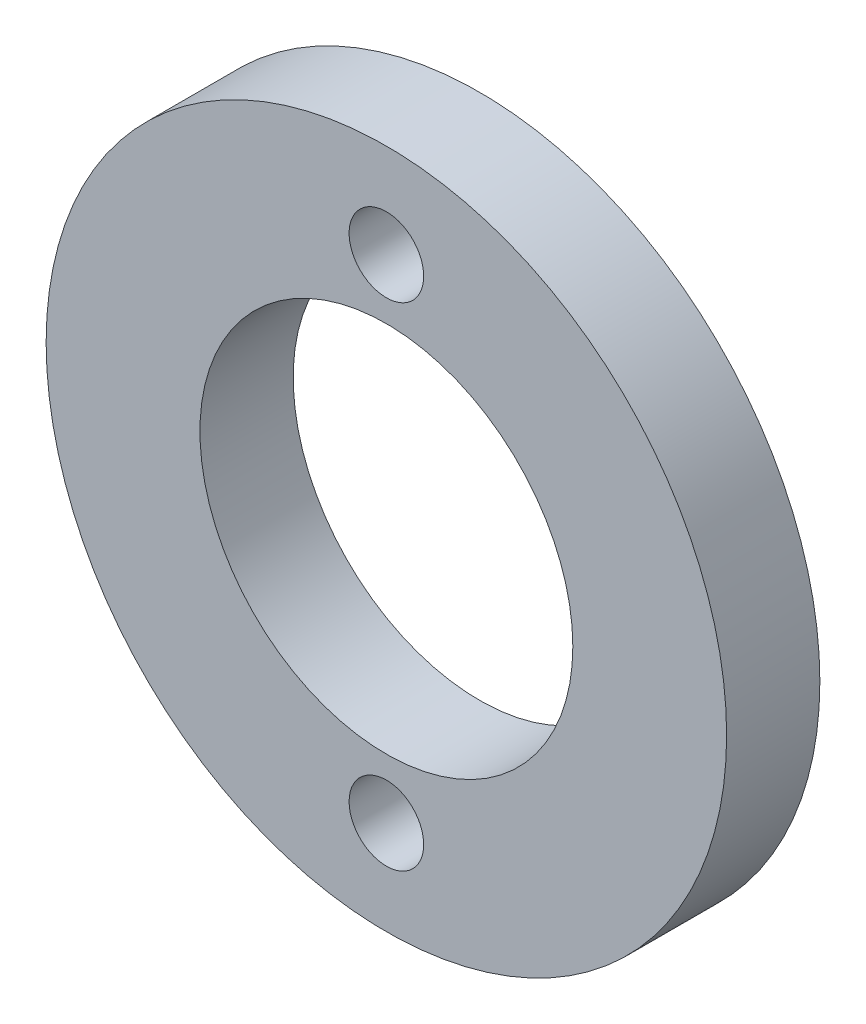
ISO-10303-21;
HEADER;
FILE_DESCRIPTION(('STEP AP214'),'2;1');
FILE_NAME('part.step','',(''),(''),'','','');
FILE_SCHEMA(('AUTOMOTIVE_DESIGN { 1 0 10303 214 1 1 1 1 }'));
ENDSEC;
DATA;
#1=APPLICATION_CONTEXT('core data for automotive mechanical design processes');
#2=APPLICATION_PROTOCOL_DEFINITION('international standard','automotive_design',2000,#1);
#3=PRODUCT_CONTEXT('',#1,'mechanical');
#4=PRODUCT('Part','Part','',(#3));
#5=PRODUCT_RELATED_PRODUCT_CATEGORY('part','',(#4));
#6=PRODUCT_DEFINITION_FORMATION('','',#4);
#7=PRODUCT_DEFINITION_CONTEXT('part definition',#1,'design');
#8=PRODUCT_DEFINITION('design','',#6,#7);
#9=PRODUCT_DEFINITION_SHAPE('','',#8);
#10=(LENGTH_UNIT() NAMED_UNIT(*) SI_UNIT(.MILLI.,.METRE.));
#11=(NAMED_UNIT(*) PLANE_ANGLE_UNIT() SI_UNIT($,.RADIAN.));
#12=(NAMED_UNIT(*) SI_UNIT($,.STERADIAN.) SOLID_ANGLE_UNIT());
#13=UNCERTAINTY_MEASURE_WITH_UNIT(LENGTH_MEASURE(1.E-05),#10,'distance_accuracy_value','');
#14=(GEOMETRIC_REPRESENTATION_CONTEXT(3) GLOBAL_UNCERTAINTY_ASSIGNED_CONTEXT((#13)) GLOBAL_UNIT_ASSIGNED_CONTEXT((#10,
#11,#12)) REPRESENTATION_CONTEXT('',''));
#15=CARTESIAN_POINT('',(0.,0.,0.));
#16=DIRECTION('',(0.,0.,1.));
#17=DIRECTION('',(1.,0.,0.));
#18=AXIS2_PLACEMENT_3D('',#15,#16,#17);
#19=CARTESIAN_POINT('',(0.,0.,5.));
#20=DIRECTION('',(0.,0.,1.));
#21=DIRECTION('',(1.,0.,0.));
#22=AXIS2_PLACEMENT_3D('',#19,#20,#21);
#23=PLANE('',#22);
#24=CARTESIAN_POINT('',(0.,-13.2,5.));
#25=DIRECTION('',(0.,0.,1.));
#26=DIRECTION('',(-1.,0.,0.));
#27=AXIS2_PLACEMENT_3D('',#24,#25,#26);
#28=CIRCLE('',#27,2.);
#29=CARTESIAN_POINT('',(-2.,-13.2,5.));
#30=VERTEX_POINT('',#29);
#31=EDGE_CURVE('E47',#30,#30,#28,.T.);
#32=ORIENTED_EDGE('',*,*,#31,.F.);
#33=EDGE_LOOP('',(#32));
#34=FACE_BOUND('',#33,.T.);
#35=CARTESIAN_POINT('',(0.,0.,5.));
#36=DIRECTION('',(0.,0.,1.));
#37=DIRECTION('',(1.,0.,0.));
#38=AXIS2_PLACEMENT_3D('',#35,#36,#37);
#39=CIRCLE('',#38,18.25);
#40=CARTESIAN_POINT('',(18.25,0.,5.));
#41=VERTEX_POINT('',#40);
#42=EDGE_CURVE('E10',#41,#41,#39,.T.);
#43=ORIENTED_EDGE('',*,*,#42,.T.);
#44=EDGE_LOOP('',(#43));
#45=FACE_BOUND('',#44,.T.);
#46=CARTESIAN_POINT('',(0.,13.2,5.));
#47=DIRECTION('',(0.,0.,1.));
#48=DIRECTION('',(1.,0.,0.));
#49=AXIS2_PLACEMENT_3D('',#46,#47,#48);
#50=CIRCLE('',#49,2.);
#51=CARTESIAN_POINT('',(2.,13.2,5.));
#52=VERTEX_POINT('',#51);
#53=EDGE_CURVE('E42',#52,#52,#50,.T.);
#54=ORIENTED_EDGE('',*,*,#53,.F.);
#55=EDGE_LOOP('',(#54));
#56=FACE_BOUND('',#55,.T.);
#57=CARTESIAN_POINT('',(0.,0.,5.));
#58=DIRECTION('',(0.,0.,1.));
#59=DIRECTION('',(1.,0.,0.));
#60=AXIS2_PLACEMENT_3D('',#57,#58,#59);
#61=CIRCLE('',#60,10.);
#62=CARTESIAN_POINT('',(10.,0.,5.));
#63=VERTEX_POINT('',#62);
#64=EDGE_CURVE('E53',#63,#63,#61,.T.);
#65=ORIENTED_EDGE('',*,*,#64,.F.);
#66=EDGE_LOOP('',(#65));
#67=FACE_BOUND('',#66,.T.);
#68=ADVANCED_FACE('F31',(#34,#45,#56,#67),#23,.T.);
#69=CARTESIAN_POINT('',(0.,0.,0.));
#70=DIRECTION('',(0.,0.,1.));
#71=DIRECTION('',(1.,0.,0.));
#72=AXIS2_PLACEMENT_3D('',#69,#70,#71);
#73=PLANE('',#72);
#74=CARTESIAN_POINT('',(0.,0.,0.));
#75=DIRECTION('',(0.,0.,1.));
#76=DIRECTION('',(1.,0.,0.));
#77=AXIS2_PLACEMENT_3D('',#74,#75,#76);
#78=CIRCLE('',#77,18.25);
#79=CARTESIAN_POINT('',(18.25,0.,0.));
#80=VERTEX_POINT('',#79);
#81=EDGE_CURVE('E35',#80,#80,#78,.T.);
#82=ORIENTED_EDGE('',*,*,#81,.F.);
#83=EDGE_LOOP('',(#82));
#84=FACE_BOUND('',#83,.T.);
#85=CARTESIAN_POINT('',(0.,13.2,0.));
#86=DIRECTION('',(0.,0.,1.));
#87=DIRECTION('',(1.,0.,0.));
#88=AXIS2_PLACEMENT_3D('',#85,#86,#87);
#89=CIRCLE('',#88,2.);
#90=CARTESIAN_POINT('',(2.,13.2,0.));
#91=VERTEX_POINT('',#90);
#92=EDGE_CURVE('E44',#91,#91,#89,.T.);
#93=ORIENTED_EDGE('',*,*,#92,.T.);
#94=EDGE_LOOP('',(#93));
#95=FACE_BOUND('',#94,.T.);
#96=CARTESIAN_POINT('',(0.,-13.2,0.));
#97=DIRECTION('',(0.,0.,1.));
#98=DIRECTION('',(-1.,0.,0.));
#99=AXIS2_PLACEMENT_3D('',#96,#97,#98);
#100=CIRCLE('',#99,2.);
#101=CARTESIAN_POINT('',(-2.,-13.2,0.));
#102=VERTEX_POINT('',#101);
#103=EDGE_CURVE('E50',#102,#102,#100,.T.);
#104=ORIENTED_EDGE('',*,*,#103,.T.);
#105=EDGE_LOOP('',(#104));
#106=FACE_BOUND('',#105,.T.);
#107=CARTESIAN_POINT('',(0.,0.,0.));
#108=DIRECTION('',(0.,0.,1.));
#109=DIRECTION('',(1.,0.,0.));
#110=AXIS2_PLACEMENT_3D('',#107,#108,#109);
#111=CIRCLE('',#110,10.);
#112=CARTESIAN_POINT('',(10.,0.,0.));
#113=VERTEX_POINT('',#112);
#114=EDGE_CURVE('E56',#113,#113,#111,.T.);
#115=ORIENTED_EDGE('',*,*,#114,.T.);
#116=EDGE_LOOP('',(#115));
#117=FACE_BOUND('',#116,.T.);
#118=ADVANCED_FACE('F66',(#84,#95,#106,#117),#73,.F.);
#119=CARTESIAN_POINT('',(0.,0.,5.));
#120=DIRECTION('',(0.,0.,-1.));
#121=DIRECTION('',(-1.,0.,0.));
#122=AXIS2_PLACEMENT_3D('',#119,#120,#121);
#123=CYLINDRICAL_SURFACE('',#122,18.25);
#124=ORIENTED_EDGE('',*,*,#42,.F.);
#125=EDGE_LOOP('',(#124));
#126=FACE_BOUND('',#125,.T.);
#127=ORIENTED_EDGE('',*,*,#81,.T.);
#128=EDGE_LOOP('',(#127));
#129=FACE_BOUND('',#128,.T.);
#130=ADVANCED_FACE('F33',(#126,#129),#123,.T.);
#131=CARTESIAN_POINT('',(0.,13.2,5.));
#132=DIRECTION('',(0.,0.,-1.));
#133=DIRECTION('',(-1.,0.,0.));
#134=AXIS2_PLACEMENT_3D('',#131,#132,#133);
#135=CYLINDRICAL_SURFACE('',#134,2.);
#136=ORIENTED_EDGE('',*,*,#53,.T.);
#137=EDGE_LOOP('',(#136));
#138=FACE_BOUND('',#137,.T.);
#139=ORIENTED_EDGE('',*,*,#92,.F.);
#140=EDGE_LOOP('',(#139));
#141=FACE_BOUND('',#140,.T.);
#142=ADVANCED_FACE('F75',(#138,#141),#135,.F.);
#143=CARTESIAN_POINT('',(0.,-13.2,5.));
#144=DIRECTION('',(0.,0.,-1.));
#145=DIRECTION('',(-1.,0.,0.));
#146=AXIS2_PLACEMENT_3D('',#143,#144,#145);
#147=CYLINDRICAL_SURFACE('',#146,2.);
#148=ORIENTED_EDGE('',*,*,#31,.T.);
#149=EDGE_LOOP('',(#148));
#150=FACE_BOUND('',#149,.T.);
#151=ORIENTED_EDGE('',*,*,#103,.F.);
#152=EDGE_LOOP('',(#151));
#153=FACE_BOUND('',#152,.T.);
#154=ADVANCED_FACE('F78',(#150,#153),#147,.F.);
#155=CARTESIAN_POINT('',(0.,0.,5.));
#156=DIRECTION('',(0.,0.,-1.));
#157=DIRECTION('',(-1.,0.,0.));
#158=AXIS2_PLACEMENT_3D('',#155,#156,#157);
#159=CYLINDRICAL_SURFACE('',#158,10.);
#160=ORIENTED_EDGE('',*,*,#64,.T.);
#161=EDGE_LOOP('',(#160));
#162=FACE_BOUND('',#161,.T.);
#163=ORIENTED_EDGE('',*,*,#114,.F.);
#164=EDGE_LOOP('',(#163));
#165=FACE_BOUND('',#164,.T.);
#166=ADVANCED_FACE('F62',(#162,#165),#159,.F.);
#167=CLOSED_SHELL('',(#68,#118,#130,#142,#154,#166));
#168=MANIFOLD_SOLID_BREP('B2',#167);
#169=ADVANCED_BREP_SHAPE_REPRESENTATION('',(#18,#168),#14);
#170=SHAPE_DEFINITION_REPRESENTATION(#9,#169);
ENDSEC;
END-ISO-10303-21;
